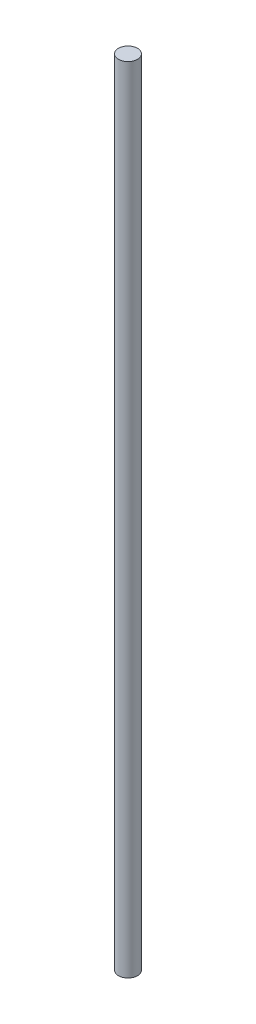
ISO-10303-21;
HEADER;
FILE_DESCRIPTION(('STEP AP214'),'2;1');
FILE_NAME('part.step','',(''),(''),'','','');
FILE_SCHEMA(('AUTOMOTIVE_DESIGN { 1 0 10303 214 1 1 1 1 }'));
ENDSEC;
DATA;
#1=APPLICATION_CONTEXT('core data for automotive mechanical design processes');
#2=APPLICATION_PROTOCOL_DEFINITION('international standard','automotive_design',2000,#1);
#3=PRODUCT_CONTEXT('',#1,'mechanical');
#4=PRODUCT('Part','Part','',(#3));
#5=PRODUCT_RELATED_PRODUCT_CATEGORY('part','',(#4));
#6=PRODUCT_DEFINITION_FORMATION('','',#4);
#7=PRODUCT_DEFINITION_CONTEXT('part definition',#1,'design');
#8=PRODUCT_DEFINITION('design','',#6,#7);
#9=PRODUCT_DEFINITION_SHAPE('','',#8);
#10=(LENGTH_UNIT() NAMED_UNIT(*) SI_UNIT(.MILLI.,.METRE.));
#11=(NAMED_UNIT(*) PLANE_ANGLE_UNIT() SI_UNIT($,.RADIAN.));
#12=(NAMED_UNIT(*) SI_UNIT($,.STERADIAN.) SOLID_ANGLE_UNIT());
#13=UNCERTAINTY_MEASURE_WITH_UNIT(LENGTH_MEASURE(1.E-05),#10,'distance_accuracy_value','');
#14=(GEOMETRIC_REPRESENTATION_CONTEXT(3) GLOBAL_UNCERTAINTY_ASSIGNED_CONTEXT((#13)) GLOBAL_UNIT_ASSIGNED_CONTEXT((#10,
#11,#12)) REPRESENTATION_CONTEXT('',''));
#15=CARTESIAN_POINT('',(0.,0.,0.));
#16=DIRECTION('',(0.,0.,1.));
#17=DIRECTION('',(1.,0.,0.));
#18=AXIS2_PLACEMENT_3D('',#15,#16,#17);
#19=CARTESIAN_POINT('',(0.,332.5,0.));
#20=DIRECTION('',(0.,-1.,0.));
#21=DIRECTION('',(0.,0.,-1.));
#22=AXIS2_PLACEMENT_3D('',#19,#20,#21);
#23=CYLINDRICAL_SURFACE('',#22,4.);
#24=CARTESIAN_POINT('',(0.,332.5,0.));
#25=DIRECTION('',(0.,1.,0.));
#26=DIRECTION('',(0.,0.,1.));
#27=AXIS2_PLACEMENT_3D('',#24,#25,#26);
#28=CIRCLE('',#27,4.);
#29=CARTESIAN_POINT('',(0.,332.5,4.));
#30=VERTEX_POINT('',#29);
#31=EDGE_CURVE('E10',#30,#30,#28,.T.);
#32=ORIENTED_EDGE('',*,*,#31,.F.);
#33=EDGE_LOOP('',(#32));
#34=FACE_BOUND('',#33,.T.);
#35=CARTESIAN_POINT('',(0.,0.,0.));
#36=DIRECTION('',(0.,1.,0.));
#37=DIRECTION('',(0.,0.,1.));
#38=AXIS2_PLACEMENT_3D('',#35,#36,#37);
#39=CIRCLE('',#38,4.);
#40=CARTESIAN_POINT('',(0.,0.,4.));
#41=VERTEX_POINT('',#40);
#42=EDGE_CURVE('E44',#41,#41,#39,.T.);
#43=ORIENTED_EDGE('',*,*,#42,.T.);
#44=EDGE_LOOP('',(#43));
#45=FACE_BOUND('',#44,.T.);
#46=ADVANCED_FACE('F41',(#34,#45),#23,.T.);
#47=CARTESIAN_POINT('',(0.,332.5,0.));
#48=DIRECTION('',(0.,1.,0.));
#49=DIRECTION('',(0.,0.,1.));
#50=AXIS2_PLACEMENT_3D('',#47,#48,#49);
#51=PLANE('',#50);
#52=ORIENTED_EDGE('',*,*,#31,.T.);
#53=EDGE_LOOP('',(#52));
#54=FACE_BOUND('',#53,.T.);
#55=ADVANCED_FACE('F58',(#54),#51,.T.);
#56=CARTESIAN_POINT('',(0.,0.,0.));
#57=DIRECTION('',(0.,1.,0.));
#58=DIRECTION('',(0.,0.,1.));
#59=AXIS2_PLACEMENT_3D('',#56,#57,#58);
#60=PLANE('',#59);
#61=ORIENTED_EDGE('',*,*,#42,.F.);
#62=EDGE_LOOP('',(#61));
#63=FACE_BOUND('',#62,.T.);
#64=ADVANCED_FACE('F56',(#63),#60,.F.);
#65=CLOSED_SHELL('',(#46,#55,#64));
#66=MANIFOLD_SOLID_BREP('B2',#65);
#67=ADVANCED_BREP_SHAPE_REPRESENTATION('',(#18,#66),#14);
#68=SHAPE_DEFINITION_REPRESENTATION(#9,#67);
ENDSEC;
END-ISO-10303-21;
